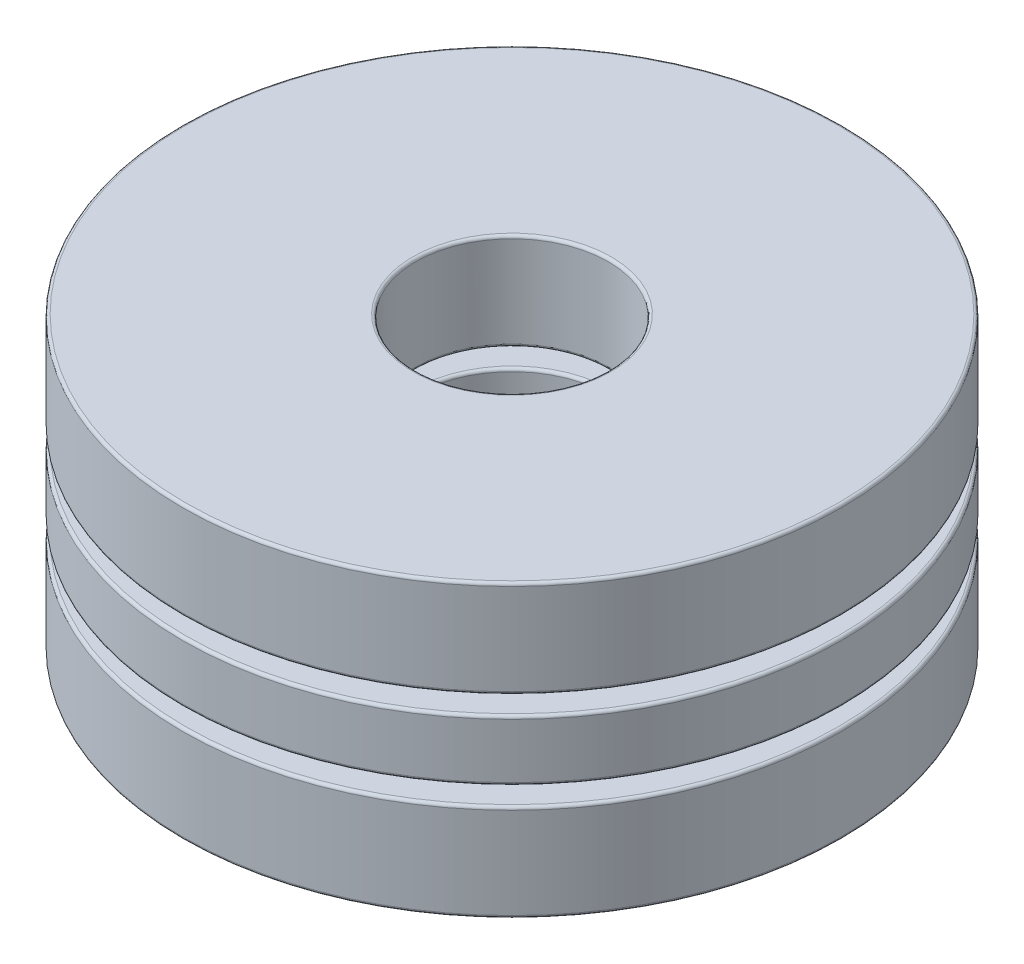
ISO-10303-21;
HEADER;
FILE_DESCRIPTION(('STEP AP214'),'2;1');
FILE_NAME('part.step','',(''),(''),'','','');
FILE_SCHEMA(('AUTOMOTIVE_DESIGN { 1 0 10303 214 1 1 1 1 }'));
ENDSEC;
DATA;
#1=APPLICATION_CONTEXT('core data for automotive mechanical design processes');
#2=APPLICATION_PROTOCOL_DEFINITION('international standard','automotive_design',2000,#1);
#3=PRODUCT_CONTEXT('',#1,'mechanical');
#4=PRODUCT('Part','Part','',(#3));
#5=PRODUCT_RELATED_PRODUCT_CATEGORY('part','',(#4));
#6=PRODUCT_DEFINITION_FORMATION('','',#4);
#7=PRODUCT_DEFINITION_CONTEXT('part definition',#1,'design');
#8=PRODUCT_DEFINITION('design','',#6,#7);
#9=PRODUCT_DEFINITION_SHAPE('','',#8);
#10=(LENGTH_UNIT() NAMED_UNIT(*) SI_UNIT(.MILLI.,.METRE.));
#11=(NAMED_UNIT(*) PLANE_ANGLE_UNIT() SI_UNIT($,.RADIAN.));
#12=(NAMED_UNIT(*) SI_UNIT($,.STERADIAN.) SOLID_ANGLE_UNIT());
#13=UNCERTAINTY_MEASURE_WITH_UNIT(LENGTH_MEASURE(1.E-05),#10,'distance_accuracy_value','');
#14=(GEOMETRIC_REPRESENTATION_CONTEXT(3) GLOBAL_UNCERTAINTY_ASSIGNED_CONTEXT((#13)) GLOBAL_UNIT_ASSIGNED_CONTEXT((#10,
#11,#12)) REPRESENTATION_CONTEXT('',''));
#15=CARTESIAN_POINT('',(0.,0.,0.));
#16=DIRECTION('',(0.,0.,1.));
#17=DIRECTION('',(1.,0.,0.));
#18=AXIS2_PLACEMENT_3D('',#15,#16,#17);
#19=CARTESIAN_POINT('',(0.,-2.4511,0.));
#20=DIRECTION('',(0.,-1.,0.));
#21=DIRECTION('',(0.,0.,-1.));
#22=AXIS2_PLACEMENT_3D('',#19,#20,#21);
#23=CYLINDRICAL_SURFACE('',#22,5.55625);
#24=CARTESIAN_POINT('',(0.,-2.402078,0.));
#25=DIRECTION('',(0.,1.,0.));
#26=DIRECTION('',(0.,0.,1.));
#27=AXIS2_PLACEMENT_3D('',#24,#25,#26);
#28=CIRCLE('',#27,5.55625);
#29=CARTESIAN_POINT('',(0.,-2.402078,5.55625));
#30=VERTEX_POINT('',#29);
#31=EDGE_CURVE('E11',#30,#30,#28,.T.);
#32=ORIENTED_EDGE('',*,*,#31,.T.);
#33=EDGE_LOOP('',(#32));
#34=FACE_BOUND('',#33,.T.);
#35=CARTESIAN_POINT('',(0.,-0.866055333333333,0.));
#36=DIRECTION('',(0.,-1.,0.));
#37=DIRECTION('',(0.,0.,-1.));
#38=AXIS2_PLACEMENT_3D('',#35,#36,#37);
#39=CIRCLE('',#38,5.55625);
#40=CARTESIAN_POINT('',(0.,-0.866055333333333,-5.55625));
#41=VERTEX_POINT('',#40);
#42=EDGE_CURVE('E53',#41,#41,#39,.T.);
#43=ORIENTED_EDGE('',*,*,#42,.T.);
#44=EDGE_LOOP('',(#43));
#45=FACE_BOUND('',#44,.T.);
#46=ADVANCED_FACE('F46',(#34,#45),#23,.T.);
#47=CARTESIAN_POINT('',(0.,-0.817033333333333,5.55625));
#48=DIRECTION('',(0.,-1.,0.));
#49=DIRECTION('',(0.,0.,-1.));
#50=AXIS2_PLACEMENT_3D('',#47,#48,#49);
#51=PLANE('',#50);
#52=CARTESIAN_POINT('',(0.,-0.817033333333333,0.));
#53=DIRECTION('',(0.,-1.,0.));
#54=DIRECTION('',(0.,0.,-1.));
#55=AXIS2_PLACEMENT_3D('',#52,#53,#54);
#56=CIRCLE('',#55,1.674622);
#57=CARTESIAN_POINT('',(0.,-0.817033333333333,-1.674622));
#58=VERTEX_POINT('',#57);
#59=EDGE_CURVE('E57',#58,#58,#56,.T.);
#60=ORIENTED_EDGE('',*,*,#59,.T.);
#61=EDGE_LOOP('',(#60));
#62=FACE_BOUND('',#61,.T.);
#63=CARTESIAN_POINT('',(0.,-0.817033333333333,0.));
#64=DIRECTION('',(0.,-1.,0.));
#65=DIRECTION('',(0.,0.,-1.));
#66=AXIS2_PLACEMENT_3D('',#63,#64,#65);
#67=CIRCLE('',#66,5.507228);
#68=CARTESIAN_POINT('',(0.,-0.817033333333333,-5.507228));
#69=VERTEX_POINT('',#68);
#70=EDGE_CURVE('E61',#69,#69,#67,.F.);
#71=ORIENTED_EDGE('',*,*,#70,.T.);
#72=EDGE_LOOP('',(#71));
#73=FACE_BOUND('',#72,.T.);
#74=ADVANCED_FACE('F89',(#62,#73),#51,.F.);
#75=CARTESIAN_POINT('',(0.,-2.4511,0.));
#76=DIRECTION('',(0.,-1.,0.));
#77=DIRECTION('',(0.,0.,-1.));
#78=AXIS2_PLACEMENT_3D('',#75,#76,#77);
#79=CYLINDRICAL_SURFACE('',#78,1.6256);
#80=CARTESIAN_POINT('',(0.,-2.402078,0.));
#81=DIRECTION('',(0.,1.,0.));
#82=DIRECTION('',(0.,0.,1.));
#83=AXIS2_PLACEMENT_3D('',#80,#81,#82);
#84=CIRCLE('',#83,1.6256);
#85=CARTESIAN_POINT('',(0.,-2.402078,1.6256));
#86=VERTEX_POINT('',#85);
#87=EDGE_CURVE('E72',#86,#86,#84,.F.);
#88=ORIENTED_EDGE('',*,*,#87,.T.);
#89=EDGE_LOOP('',(#88));
#90=FACE_BOUND('',#89,.T.);
#91=CARTESIAN_POINT('',(0.,-0.866055333333333,0.));
#92=DIRECTION('',(0.,-1.,0.));
#93=DIRECTION('',(0.,0.,-1.));
#94=AXIS2_PLACEMENT_3D('',#91,#92,#93);
#95=CIRCLE('',#94,1.6256);
#96=CARTESIAN_POINT('',(0.,-0.866055333333333,-1.6256));
#97=VERTEX_POINT('',#96);
#98=EDGE_CURVE('E75',#97,#97,#95,.F.);
#99=ORIENTED_EDGE('',*,*,#98,.T.);
#100=EDGE_LOOP('',(#99));
#101=FACE_BOUND('',#100,.T.);
#102=ADVANCED_FACE('F79',(#90,#101),#79,.F.);
#103=CARTESIAN_POINT('',(0.,-2.4511,5.55625));
#104=DIRECTION('',(0.,1.,0.));
#105=DIRECTION('',(0.,0.,1.));
#106=AXIS2_PLACEMENT_3D('',#103,#104,#105);
#107=PLANE('',#106);
#108=CARTESIAN_POINT('',(0.,-2.4511,0.));
#109=DIRECTION('',(0.,1.,0.));
#110=DIRECTION('',(0.,0.,1.));
#111=AXIS2_PLACEMENT_3D('',#108,#109,#110);
#112=CIRCLE('',#111,1.674622);
#113=CARTESIAN_POINT('',(0.,-2.4511,1.674622));
#114=VERTEX_POINT('',#113);
#115=EDGE_CURVE('E66',#114,#114,#112,.T.);
#116=ORIENTED_EDGE('',*,*,#115,.T.);
#117=EDGE_LOOP('',(#116));
#118=FACE_BOUND('',#117,.T.);
#119=CARTESIAN_POINT('',(0.,-2.4511,0.));
#120=DIRECTION('',(0.,1.,0.));
#121=DIRECTION('',(0.,0.,1.));
#122=AXIS2_PLACEMENT_3D('',#119,#120,#121);
#123=CIRCLE('',#122,5.507228);
#124=CARTESIAN_POINT('',(0.,-2.4511,5.507228));
#125=VERTEX_POINT('',#124);
#126=EDGE_CURVE('E69',#125,#125,#123,.F.);
#127=ORIENTED_EDGE('',*,*,#126,.T.);
#128=EDGE_LOOP('',(#127));
#129=FACE_BOUND('',#128,.T.);
#130=ADVANCED_FACE('F108',(#118,#129),#107,.F.);
#131=CARTESIAN_POINT('',(0.,-2.402078,0.));
#132=DIRECTION('',(0.,1.,0.));
#133=DIRECTION('',(0.,0.,1.));
#134=AXIS2_PLACEMENT_3D('',#131,#132,#133);
#135=TOROIDAL_SURFACE('',#134,1.674622,0.049022);
#136=ORIENTED_EDGE('',*,*,#115,.F.);
#137=EDGE_LOOP('',(#136));
#138=FACE_BOUND('',#137,.T.);
#139=ORIENTED_EDGE('',*,*,#87,.F.);
#140=EDGE_LOOP('',(#139));
#141=FACE_BOUND('',#140,.T.);
#142=ADVANCED_FACE('F85',(#138,#141),#135,.T.);
#143=CARTESIAN_POINT('',(0.,-0.866055333333333,0.));
#144=DIRECTION('',(0.,-1.,0.));
#145=DIRECTION('',(0.,0.,-1.));
#146=AXIS2_PLACEMENT_3D('',#143,#144,#145);
#147=TOROIDAL_SURFACE('',#146,1.674622,0.049022);
#148=ORIENTED_EDGE('',*,*,#98,.F.);
#149=EDGE_LOOP('',(#148));
#150=FACE_BOUND('',#149,.T.);
#151=ORIENTED_EDGE('',*,*,#59,.F.);
#152=EDGE_LOOP('',(#151));
#153=FACE_BOUND('',#152,.T.);
#154=ADVANCED_FACE('F81',(#150,#153),#147,.T.);
#155=CARTESIAN_POINT('',(0.,-2.402078,0.));
#156=DIRECTION('',(0.,1.,0.));
#157=DIRECTION('',(0.,0.,1.));
#158=AXIS2_PLACEMENT_3D('',#155,#156,#157);
#159=TOROIDAL_SURFACE('',#158,5.507228,0.049022);
#160=ORIENTED_EDGE('',*,*,#31,.F.);
#161=EDGE_LOOP('',(#160));
#162=FACE_BOUND('',#161,.T.);
#163=ORIENTED_EDGE('',*,*,#126,.F.);
#164=EDGE_LOOP('',(#163));
#165=FACE_BOUND('',#164,.T.);
#166=ADVANCED_FACE('F84',(#162,#165),#159,.T.);
#167=CARTESIAN_POINT('',(0.,-0.866055333333333,0.));
#168=DIRECTION('',(0.,-1.,0.));
#169=DIRECTION('',(0.,0.,-1.));
#170=AXIS2_PLACEMENT_3D('',#167,#168,#169);
#171=TOROIDAL_SURFACE('',#170,5.507228,0.049022);
#172=ORIENTED_EDGE('',*,*,#70,.F.);
#173=EDGE_LOOP('',(#172));
#174=FACE_BOUND('',#173,.T.);
#175=ORIENTED_EDGE('',*,*,#42,.F.);
#176=EDGE_LOOP('',(#175));
#177=FACE_BOUND('',#176,.T.);
#178=ADVANCED_FACE('F48',(#174,#177),#171,.T.);
#179=CLOSED_SHELL('',(#46,#74,#102,#130,#142,#154,#166,#178));
#180=MANIFOLD_SOLID_BREP('B2',#179);
#181=CARTESIAN_POINT('',(0.,-2.4511,0.));
#182=DIRECTION('',(0.,-1.,0.));
#183=DIRECTION('',(0.,0.,-1.));
#184=AXIS2_PLACEMENT_3D('',#181,#182,#183);
#185=CYLINDRICAL_SURFACE('',#184,5.55625);
#186=CARTESIAN_POINT('',(0.,0.866055333333334,0.));
#187=DIRECTION('',(0.,1.,0.));
#188=DIRECTION('',(0.,0.,1.));
#189=AXIS2_PLACEMENT_3D('',#186,#187,#188);
#190=CIRCLE('',#189,5.55625);
#191=CARTESIAN_POINT('',(0.,0.866055333333334,5.55625));
#192=VERTEX_POINT('',#191);
#193=EDGE_CURVE('E45',#192,#192,#190,.T.);
#194=ORIENTED_EDGE('',*,*,#193,.T.);
#195=EDGE_LOOP('',(#194));
#196=FACE_BOUND('',#195,.T.);
#197=CARTESIAN_POINT('',(0.,2.402078,0.));
#198=DIRECTION('',(0.,-1.,0.));
#199=DIRECTION('',(0.,0.,-1.));
#200=AXIS2_PLACEMENT_3D('',#197,#198,#199);
#201=CIRCLE('',#200,5.55625);
#202=CARTESIAN_POINT('',(0.,2.402078,-5.55625));
#203=VERTEX_POINT('',#202);
#204=EDGE_CURVE('E181',#203,#203,#201,.T.);
#205=ORIENTED_EDGE('',*,*,#204,.T.);
#206=EDGE_LOOP('',(#205));
#207=FACE_BOUND('',#206,.T.);
#208=ADVANCED_FACE('F174',(#196,#207),#185,.T.);
#209=CARTESIAN_POINT('',(0.,2.4511,5.55625));
#210=DIRECTION('',(0.,-1.,0.));
#211=DIRECTION('',(0.,0.,-1.));
#212=AXIS2_PLACEMENT_3D('',#209,#210,#211);
#213=PLANE('',#212);
#214=CARTESIAN_POINT('',(0.,2.4511,0.));
#215=DIRECTION('',(0.,-1.,0.));
#216=DIRECTION('',(0.,0.,-1.));
#217=AXIS2_PLACEMENT_3D('',#214,#215,#216);
#218=CIRCLE('',#217,1.674622);
#219=CARTESIAN_POINT('',(0.,2.4511,-1.674622));
#220=VERTEX_POINT('',#219);
#221=EDGE_CURVE('E185',#220,#220,#218,.T.);
#222=ORIENTED_EDGE('',*,*,#221,.T.);
#223=EDGE_LOOP('',(#222));
#224=FACE_BOUND('',#223,.T.);
#225=CARTESIAN_POINT('',(0.,2.4511,0.));
#226=DIRECTION('',(0.,-1.,0.));
#227=DIRECTION('',(0.,0.,-1.));
#228=AXIS2_PLACEMENT_3D('',#225,#226,#227);
#229=CIRCLE('',#228,5.507228);
#230=CARTESIAN_POINT('',(0.,2.4511,-5.507228));
#231=VERTEX_POINT('',#230);
#232=EDGE_CURVE('E189',#231,#231,#229,.F.);
#233=ORIENTED_EDGE('',*,*,#232,.T.);
#234=EDGE_LOOP('',(#233));
#235=FACE_BOUND('',#234,.T.);
#236=ADVANCED_FACE('F217',(#224,#235),#213,.F.);
#237=CARTESIAN_POINT('',(0.,-2.4511,0.));
#238=DIRECTION('',(0.,-1.,0.));
#239=DIRECTION('',(0.,0.,-1.));
#240=AXIS2_PLACEMENT_3D('',#237,#238,#239);
#241=CYLINDRICAL_SURFACE('',#240,1.6256);
#242=CARTESIAN_POINT('',(0.,0.866055333333334,0.));
#243=DIRECTION('',(0.,1.,0.));
#244=DIRECTION('',(0.,0.,1.));
#245=AXIS2_PLACEMENT_3D('',#242,#243,#244);
#246=CIRCLE('',#245,1.6256);
#247=CARTESIAN_POINT('',(0.,0.866055333333334,1.6256));
#248=VERTEX_POINT('',#247);
#249=EDGE_CURVE('E200',#248,#248,#246,.F.);
#250=ORIENTED_EDGE('',*,*,#249,.T.);
#251=EDGE_LOOP('',(#250));
#252=FACE_BOUND('',#251,.T.);
#253=CARTESIAN_POINT('',(0.,2.402078,0.));
#254=DIRECTION('',(0.,-1.,0.));
#255=DIRECTION('',(0.,0.,-1.));
#256=AXIS2_PLACEMENT_3D('',#253,#254,#255);
#257=CIRCLE('',#256,1.6256);
#258=CARTESIAN_POINT('',(0.,2.402078,-1.6256));
#259=VERTEX_POINT('',#258);
#260=EDGE_CURVE('E203',#259,#259,#257,.F.);
#261=ORIENTED_EDGE('',*,*,#260,.T.);
#262=EDGE_LOOP('',(#261));
#263=FACE_BOUND('',#262,.T.);
#264=ADVANCED_FACE('F207',(#252,#263),#241,.F.);
#265=CARTESIAN_POINT('',(0.,0.817033333333334,5.55625));
#266=DIRECTION('',(0.,1.,0.));
#267=DIRECTION('',(0.,0.,1.));
#268=AXIS2_PLACEMENT_3D('',#265,#266,#267);
#269=PLANE('',#268);
#270=CARTESIAN_POINT('',(0.,0.817033333333334,0.));
#271=DIRECTION('',(0.,1.,0.));
#272=DIRECTION('',(0.,0.,1.));
#273=AXIS2_PLACEMENT_3D('',#270,#271,#272);
#274=CIRCLE('',#273,1.674622);
#275=CARTESIAN_POINT('',(0.,0.817033333333334,1.674622));
#276=VERTEX_POINT('',#275);
#277=EDGE_CURVE('E194',#276,#276,#274,.T.);
#278=ORIENTED_EDGE('',*,*,#277,.T.);
#279=EDGE_LOOP('',(#278));
#280=FACE_BOUND('',#279,.T.);
#281=CARTESIAN_POINT('',(0.,0.817033333333334,0.));
#282=DIRECTION('',(0.,1.,0.));
#283=DIRECTION('',(0.,0.,1.));
#284=AXIS2_PLACEMENT_3D('',#281,#282,#283);
#285=CIRCLE('',#284,5.507228);
#286=CARTESIAN_POINT('',(0.,0.817033333333334,5.507228));
#287=VERTEX_POINT('',#286);
#288=EDGE_CURVE('E197',#287,#287,#285,.F.);
#289=ORIENTED_EDGE('',*,*,#288,.T.);
#290=EDGE_LOOP('',(#289));
#291=FACE_BOUND('',#290,.T.);
#292=ADVANCED_FACE('F236',(#280,#291),#269,.F.);
#293=CARTESIAN_POINT('',(0.,0.866055333333334,0.));
#294=DIRECTION('',(0.,1.,0.));
#295=DIRECTION('',(0.,0.,1.));
#296=AXIS2_PLACEMENT_3D('',#293,#294,#295);
#297=TOROIDAL_SURFACE('',#296,1.674622,0.049022);
#298=ORIENTED_EDGE('',*,*,#277,.F.);
#299=EDGE_LOOP('',(#298));
#300=FACE_BOUND('',#299,.T.);
#301=ORIENTED_EDGE('',*,*,#249,.F.);
#302=EDGE_LOOP('',(#301));
#303=FACE_BOUND('',#302,.T.);
#304=ADVANCED_FACE('F213',(#300,#303),#297,.T.);
#305=CARTESIAN_POINT('',(0.,2.402078,0.));
#306=DIRECTION('',(0.,-1.,0.));
#307=DIRECTION('',(0.,0.,-1.));
#308=AXIS2_PLACEMENT_3D('',#305,#306,#307);
#309=TOROIDAL_SURFACE('',#308,1.674622,0.049022);
#310=ORIENTED_EDGE('',*,*,#260,.F.);
#311=EDGE_LOOP('',(#310));
#312=FACE_BOUND('',#311,.T.);
#313=ORIENTED_EDGE('',*,*,#221,.F.);
#314=EDGE_LOOP('',(#313));
#315=FACE_BOUND('',#314,.T.);
#316=ADVANCED_FACE('F209',(#312,#315),#309,.T.);
#317=CARTESIAN_POINT('',(0.,0.866055333333334,0.));
#318=DIRECTION('',(0.,1.,0.));
#319=DIRECTION('',(0.,0.,1.));
#320=AXIS2_PLACEMENT_3D('',#317,#318,#319);
#321=TOROIDAL_SURFACE('',#320,5.507228,0.049022);
#322=ORIENTED_EDGE('',*,*,#193,.F.);
#323=EDGE_LOOP('',(#322));
#324=FACE_BOUND('',#323,.T.);
#325=ORIENTED_EDGE('',*,*,#288,.F.);
#326=EDGE_LOOP('',(#325));
#327=FACE_BOUND('',#326,.T.);
#328=ADVANCED_FACE('F212',(#324,#327),#321,.T.);
#329=CARTESIAN_POINT('',(0.,2.402078,0.));
#330=DIRECTION('',(0.,-1.,0.));
#331=DIRECTION('',(0.,0.,-1.));
#332=AXIS2_PLACEMENT_3D('',#329,#330,#331);
#333=TOROIDAL_SURFACE('',#332,5.507228,0.049022);
#334=ORIENTED_EDGE('',*,*,#232,.F.);
#335=EDGE_LOOP('',(#334));
#336=FACE_BOUND('',#335,.T.);
#337=ORIENTED_EDGE('',*,*,#204,.F.);
#338=EDGE_LOOP('',(#337));
#339=FACE_BOUND('',#338,.T.);
#340=ADVANCED_FACE('F176',(#336,#339),#333,.T.);
#341=CLOSED_SHELL('',(#208,#236,#264,#292,#304,#316,#328,#340));
#342=MANIFOLD_SOLID_BREP('B6',#341);
#343=CARTESIAN_POINT('',(0.,0.,-3.590925));
#344=DIRECTION('',(0.,1.,0.));
#345=DIRECTION('',(0.,0.,1.));
#346=AXIS2_PLACEMENT_3D('',#343,#344,#345);
#347=SPHERICAL_SURFACE('',#346,0.817033333333333);
#348=CARTESIAN_POINT('',(0.,0.817033333333333,-3.590925));
#349=VERTEX_POINT('',#348);
#350=VERTEX_LOOP('',#349);
#351=FACE_BOUND('',#350,.T.);
#352=ADVANCED_FACE('F302',(#351),#347,.T.);
#353=CLOSED_SHELL('',(#352));
#354=MANIFOLD_SOLID_BREP('B40',#353);
#355=CARTESIAN_POINT('',(0.,0.,3.590925));
#356=DIRECTION('',(0.,1.,0.));
#357=DIRECTION('',(0.,0.,-1.));
#358=AXIS2_PLACEMENT_3D('',#355,#356,#357);
#359=SPHERICAL_SURFACE('',#358,0.817033333333333);
#360=CARTESIAN_POINT('',(0.,0.817033333333333,3.590925));
#361=VERTEX_POINT('',#360);
#362=VERTEX_LOOP('',#361);
#363=FACE_BOUND('',#362,.T.);
#364=ADVANCED_FACE('F320',(#363),#359,.T.);
#365=CLOSED_SHELL('',(#364));
#366=MANIFOLD_SOLID_BREP('B170',#365);
#367=CARTESIAN_POINT('',(0.,-2.4511,0.));
#368=DIRECTION('',(0.,-1.,0.));
#369=DIRECTION('',(0.,0.,-1.));
#370=AXIS2_PLACEMENT_3D('',#367,#368,#369);
#371=CYLINDRICAL_SURFACE('',#370,5.55625);
#372=CARTESIAN_POINT('',(0.,-0.461623833333335,0.));
#373=DIRECTION('',(0.,1.,0.));
#374=DIRECTION('',(0.,0.,1.));
#375=AXIS2_PLACEMENT_3D('',#372,#373,#374);
#376=CIRCLE('',#375,5.55625);
#377=CARTESIAN_POINT('',(0.,-0.461623833333335,5.55625));
#378=VERTEX_POINT('',#377);
#379=EDGE_CURVE('E319',#378,#378,#376,.T.);
#380=ORIENTED_EDGE('',*,*,#379,.T.);
#381=EDGE_LOOP('',(#380));
#382=FACE_BOUND('',#381,.T.);
#383=CARTESIAN_POINT('',(0.,0.461623833333332,0.));
#384=DIRECTION('',(0.,-1.,0.));
#385=DIRECTION('',(0.,0.,-1.));
#386=AXIS2_PLACEMENT_3D('',#383,#384,#385);
#387=CIRCLE('',#386,5.55625);
#388=CARTESIAN_POINT('',(0.,0.461623833333332,-5.55625));
#389=VERTEX_POINT('',#388);
#390=EDGE_CURVE('E338',#389,#389,#387,.T.);
#391=ORIENTED_EDGE('',*,*,#390,.T.);
#392=EDGE_LOOP('',(#391));
#393=FACE_BOUND('',#392,.T.);
#394=ADVANCED_FACE('F331',(#382,#393),#371,.T.);
#395=CARTESIAN_POINT('',(0.,-0.510645833333334,5.55625));
#396=DIRECTION('',(0.,1.,0.));
#397=DIRECTION('',(0.,0.,1.));
#398=AXIS2_PLACEMENT_3D('',#395,#396,#397);
#399=PLANE('',#398);
#400=CARTESIAN_POINT('',(0.,-0.510645833333334,0.));
#401=DIRECTION('',(0.,1.,0.));
#402=DIRECTION('',(0.,0.,1.));
#403=AXIS2_PLACEMENT_3D('',#400,#401,#402);
#404=CIRCLE('',#403,1.674622);
#405=CARTESIAN_POINT('',(0.,-0.510645833333334,1.674622));
#406=VERTEX_POINT('',#405);
#407=EDGE_CURVE('E351',#406,#406,#404,.T.);
#408=ORIENTED_EDGE('',*,*,#407,.T.);
#409=EDGE_LOOP('',(#408));
#410=FACE_BOUND('',#409,.T.);
#411=CARTESIAN_POINT('',(0.,-0.510645833333334,0.));
#412=DIRECTION('',(0.,1.,0.));
#413=DIRECTION('',(0.,0.,1.));
#414=AXIS2_PLACEMENT_3D('',#411,#412,#413);
#415=CIRCLE('',#414,5.507228);
#416=CARTESIAN_POINT('',(0.,-0.510645833333334,5.507228));
#417=VERTEX_POINT('',#416);
#418=EDGE_CURVE('E354',#417,#417,#415,.F.);
#419=ORIENTED_EDGE('',*,*,#418,.T.);
#420=EDGE_LOOP('',(#419));
#421=FACE_BOUND('',#420,.T.);
#422=CARTESIAN_POINT('',(0.,-0.510645833333334,-3.590925));
#423=DIRECTION('',(0.,1.,0.));
#424=DIRECTION('',(0.,0.,-1.));
#425=AXIS2_PLACEMENT_3D('',#422,#423,#424);
#426=CIRCLE('',#425,0.637796441411429);
#427=CARTESIAN_POINT('',(0.,-0.510645833333334,-4.22872144141143));
#428=VERTEX_POINT('',#427);
#429=EDGE_CURVE('E367',#428,#428,#426,.T.);
#430=ORIENTED_EDGE('',*,*,#429,.T.);
#431=EDGE_LOOP('',(#430));
#432=FACE_BOUND('',#431,.T.);
#433=CARTESIAN_POINT('',(0.,-0.510645833333334,3.590925));
#434=DIRECTION('',(0.,1.,0.));
#435=DIRECTION('',(0.,0.,1.));
#436=AXIS2_PLACEMENT_3D('',#433,#434,#435);
#437=CIRCLE('',#436,0.637796441411429);
#438=CARTESIAN_POINT('',(0.,-0.510645833333334,4.22872144141143));
#439=VERTEX_POINT('',#438);
#440=EDGE_CURVE('E363',#439,#439,#437,.T.);
#441=ORIENTED_EDGE('',*,*,#440,.T.);
#442=EDGE_LOOP('',(#441));
#443=FACE_BOUND('',#442,.T.);
#444=ADVANCED_FACE('F387',(#410,#421,#432,#443),#399,.F.);
#445=CARTESIAN_POINT('',(0.,-2.4511,0.));
#446=DIRECTION('',(0.,-1.,0.));
#447=DIRECTION('',(0.,0.,-1.));
#448=AXIS2_PLACEMENT_3D('',#445,#446,#447);
#449=CYLINDRICAL_SURFACE('',#448,1.6256);
#450=CARTESIAN_POINT('',(0.,-0.461623833333335,0.));
#451=DIRECTION('',(0.,1.,0.));
#452=DIRECTION('',(0.,0.,1.));
#453=AXIS2_PLACEMENT_3D('',#450,#451,#452);
#454=CIRCLE('',#453,1.6256);
#455=CARTESIAN_POINT('',(0.,-0.461623833333335,1.6256));
#456=VERTEX_POINT('',#455);
#457=EDGE_CURVE('E357',#456,#456,#454,.F.);
#458=ORIENTED_EDGE('',*,*,#457,.T.);
#459=EDGE_LOOP('',(#458));
#460=FACE_BOUND('',#459,.T.);
#461=CARTESIAN_POINT('',(0.,0.461623833333332,0.));
#462=DIRECTION('',(0.,-1.,0.));
#463=DIRECTION('',(0.,0.,-1.));
#464=AXIS2_PLACEMENT_3D('',#461,#462,#463);
#465=CIRCLE('',#464,1.6256);
#466=CARTESIAN_POINT('',(0.,0.461623833333332,-1.6256));
#467=VERTEX_POINT('',#466);
#468=EDGE_CURVE('E360',#467,#467,#465,.F.);
#469=ORIENTED_EDGE('',*,*,#468,.T.);
#470=EDGE_LOOP('',(#469));
#471=FACE_BOUND('',#470,.T.);
#472=ADVANCED_FACE('F390',(#460,#471),#449,.F.);
#473=CARTESIAN_POINT('',(0.,0.510645833333332,5.55625));
#474=DIRECTION('',(0.,-1.,0.));
#475=DIRECTION('',(0.,0.,-1.));
#476=AXIS2_PLACEMENT_3D('',#473,#474,#475);
#477=PLANE('',#476);
#478=CARTESIAN_POINT('',(0.,0.510645833333332,0.));
#479=DIRECTION('',(0.,-1.,0.));
#480=DIRECTION('',(0.,0.,-1.));
#481=AXIS2_PLACEMENT_3D('',#478,#479,#480);
#482=CIRCLE('',#481,1.674622);
#483=CARTESIAN_POINT('',(0.,0.510645833333332,-1.674622));
#484=VERTEX_POINT('',#483);
#485=EDGE_CURVE('E342',#484,#484,#482,.T.);
#486=ORIENTED_EDGE('',*,*,#485,.T.);
#487=EDGE_LOOP('',(#486));
#488=FACE_BOUND('',#487,.T.);
#489=CARTESIAN_POINT('',(0.,0.510645833333332,0.));
#490=DIRECTION('',(0.,-1.,0.));
#491=DIRECTION('',(0.,0.,-1.));
#492=AXIS2_PLACEMENT_3D('',#489,#490,#491);
#493=CIRCLE('',#492,5.507228);
#494=CARTESIAN_POINT('',(0.,0.510645833333332,-5.507228));
#495=VERTEX_POINT('',#494);
#496=EDGE_CURVE('E346',#495,#495,#493,.F.);
#497=ORIENTED_EDGE('',*,*,#496,.T.);
#498=EDGE_LOOP('',(#497));
#499=FACE_BOUND('',#498,.T.);
#500=CARTESIAN_POINT('',(0.,0.510645833333332,-3.590925));
#501=DIRECTION('',(0.,-1.,0.));
#502=DIRECTION('',(0.,0.,1.));
#503=AXIS2_PLACEMENT_3D('',#500,#501,#502);
#504=CIRCLE('',#503,0.637796441411431);
#505=CARTESIAN_POINT('',(0.,0.510645833333332,-2.95312855858857));
#506=VERTEX_POINT('',#505);
#507=EDGE_CURVE('E372',#506,#506,#504,.T.);
#508=ORIENTED_EDGE('',*,*,#507,.T.);
#509=EDGE_LOOP('',(#508));
#510=FACE_BOUND('',#509,.T.);
#511=CARTESIAN_POINT('',(0.,0.510645833333332,3.590925));
#512=DIRECTION('',(0.,-1.,0.));
#513=DIRECTION('',(0.,0.,-1.));
#514=AXIS2_PLACEMENT_3D('',#511,#512,#513);
#515=CIRCLE('',#514,0.637796441411431);
#516=CARTESIAN_POINT('',(0.,0.510645833333332,2.95312855858857));
#517=VERTEX_POINT('',#516);
#518=EDGE_CURVE('E364',#517,#517,#515,.T.);
#519=ORIENTED_EDGE('',*,*,#518,.T.);
#520=EDGE_LOOP('',(#519));
#521=FACE_BOUND('',#520,.T.);
#522=ADVANCED_FACE('F376',(#488,#499,#510,#521),#477,.F.);
#523=CARTESIAN_POINT('',(0.,0.,3.590925));
#524=DIRECTION('',(0.,1.,0.));
#525=DIRECTION('',(0.,0.,-1.));
#526=AXIS2_PLACEMENT_3D('',#523,#524,#525);
#527=SPHERICAL_SURFACE('',#526,0.817033333333333);
#528=ORIENTED_EDGE('',*,*,#518,.F.);
#529=EDGE_LOOP('',(#528));
#530=FACE_BOUND('',#529,.T.);
#531=ORIENTED_EDGE('',*,*,#440,.F.);
#532=EDGE_LOOP('',(#531));
#533=FACE_BOUND('',#532,.T.);
#534=ADVANCED_FACE('F383',(#530,#533),#527,.F.);
#535=CARTESIAN_POINT('',(0.,0.,-3.590925));
#536=DIRECTION('',(0.,1.,0.));
#537=DIRECTION('',(0.,0.,1.));
#538=AXIS2_PLACEMENT_3D('',#535,#536,#537);
#539=SPHERICAL_SURFACE('',#538,0.817033333333333);
#540=ORIENTED_EDGE('',*,*,#507,.F.);
#541=EDGE_LOOP('',(#540));
#542=FACE_BOUND('',#541,.T.);
#543=ORIENTED_EDGE('',*,*,#429,.F.);
#544=EDGE_LOOP('',(#543));
#545=FACE_BOUND('',#544,.T.);
#546=ADVANCED_FACE('F379',(#542,#545),#539,.F.);
#547=CARTESIAN_POINT('',(0.,-0.461623833333335,0.));
#548=DIRECTION('',(0.,1.,0.));
#549=DIRECTION('',(0.,0.,1.));
#550=AXIS2_PLACEMENT_3D('',#547,#548,#549);
#551=TOROIDAL_SURFACE('',#550,1.674622,0.049022);
#552=ORIENTED_EDGE('',*,*,#407,.F.);
#553=EDGE_LOOP('',(#552));
#554=FACE_BOUND('',#553,.T.);
#555=ORIENTED_EDGE('',*,*,#457,.F.);
#556=EDGE_LOOP('',(#555));
#557=FACE_BOUND('',#556,.T.);
#558=ADVANCED_FACE('F382',(#554,#557),#551,.T.);
#559=CARTESIAN_POINT('',(0.,0.461623833333332,0.));
#560=DIRECTION('',(0.,-1.,0.));
#561=DIRECTION('',(0.,0.,-1.));
#562=AXIS2_PLACEMENT_3D('',#559,#560,#561);
#563=TOROIDAL_SURFACE('',#562,1.674622,0.049022);
#564=ORIENTED_EDGE('',*,*,#468,.F.);
#565=EDGE_LOOP('',(#564));
#566=FACE_BOUND('',#565,.T.);
#567=ORIENTED_EDGE('',*,*,#485,.F.);
#568=EDGE_LOOP('',(#567));
#569=FACE_BOUND('',#568,.T.);
#570=ADVANCED_FACE('F412',(#566,#569),#563,.T.);
#571=CARTESIAN_POINT('',(0.,-0.461623833333335,0.));
#572=DIRECTION('',(0.,1.,0.));
#573=DIRECTION('',(0.,0.,1.));
#574=AXIS2_PLACEMENT_3D('',#571,#572,#573);
#575=TOROIDAL_SURFACE('',#574,5.507228,0.049022);
#576=ORIENTED_EDGE('',*,*,#379,.F.);
#577=EDGE_LOOP('',(#576));
#578=FACE_BOUND('',#577,.T.);
#579=ORIENTED_EDGE('',*,*,#418,.F.);
#580=EDGE_LOOP('',(#579));
#581=FACE_BOUND('',#580,.T.);
#582=ADVANCED_FACE('F415',(#578,#581),#575,.T.);
#583=CARTESIAN_POINT('',(0.,0.461623833333332,0.));
#584=DIRECTION('',(0.,-1.,0.));
#585=DIRECTION('',(0.,0.,-1.));
#586=AXIS2_PLACEMENT_3D('',#583,#584,#585);
#587=TOROIDAL_SURFACE('',#586,5.507228,0.049022);
#588=ORIENTED_EDGE('',*,*,#496,.F.);
#589=EDGE_LOOP('',(#588));
#590=FACE_BOUND('',#589,.T.);
#591=ORIENTED_EDGE('',*,*,#390,.F.);
#592=EDGE_LOOP('',(#591));
#593=FACE_BOUND('',#592,.T.);
#594=ADVANCED_FACE('F333',(#590,#593),#587,.T.);
#595=CLOSED_SHELL('',(#394,#444,#472,#522,#534,#546,#558,#570,#582,#594));
#596=MANIFOLD_SOLID_BREP('B298',#595);
#597=ADVANCED_BREP_SHAPE_REPRESENTATION('',(#18,#180,#342,#354,#366,#596),#14);
#598=SHAPE_DEFINITION_REPRESENTATION(#9,#597);
ENDSEC;
END-ISO-10303-21;
